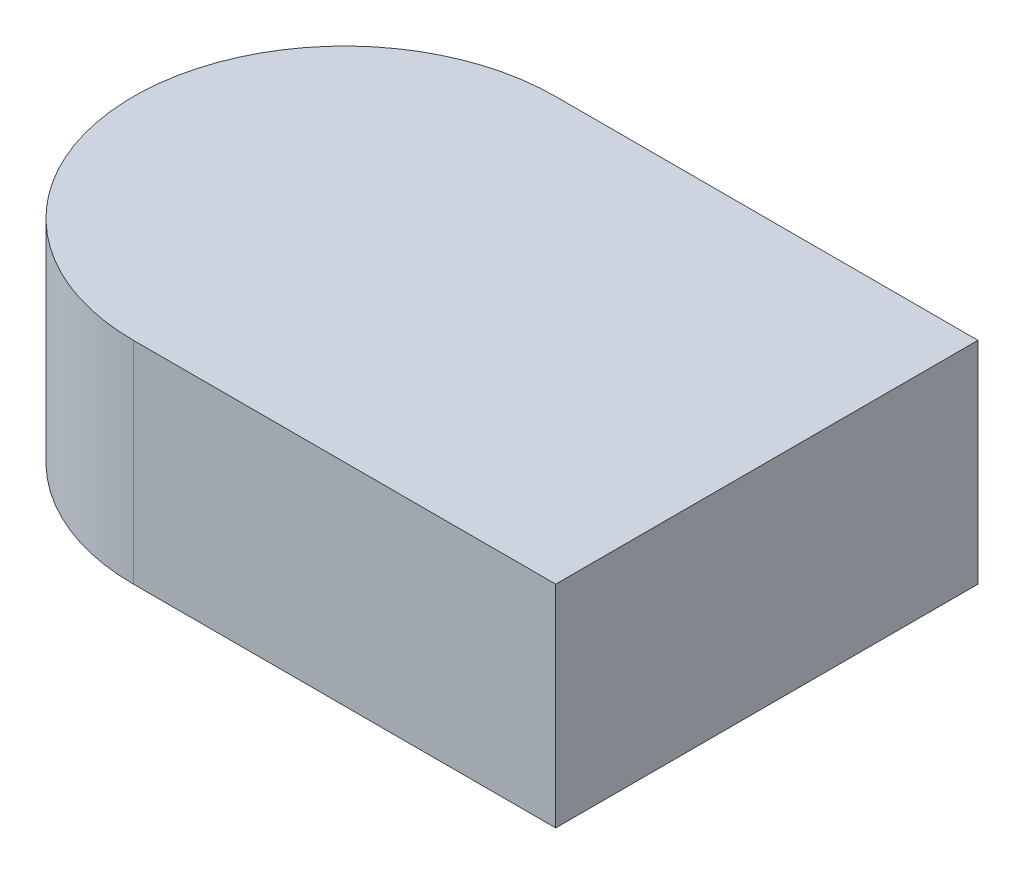
ISO-10303-21;
HEADER;
FILE_DESCRIPTION(('STEP AP214'),'2;1');
FILE_NAME('part.step','',(''),(''),'','','');
FILE_SCHEMA(('AUTOMOTIVE_DESIGN { 1 0 10303 214 1 1 1 1 }'));
ENDSEC;
DATA;
#1=APPLICATION_CONTEXT('core data for automotive mechanical design processes');
#2=APPLICATION_PROTOCOL_DEFINITION('international standard','automotive_design',2000,#1);
#3=PRODUCT_CONTEXT('',#1,'mechanical');
#4=PRODUCT('Part','Part','',(#3));
#5=PRODUCT_RELATED_PRODUCT_CATEGORY('part','',(#4));
#6=PRODUCT_DEFINITION_FORMATION('','',#4);
#7=PRODUCT_DEFINITION_CONTEXT('part definition',#1,'design');
#8=PRODUCT_DEFINITION('design','',#6,#7);
#9=PRODUCT_DEFINITION_SHAPE('','',#8);
#10=(LENGTH_UNIT() NAMED_UNIT(*) SI_UNIT(.MILLI.,.METRE.));
#11=(NAMED_UNIT(*) PLANE_ANGLE_UNIT() SI_UNIT($,.RADIAN.));
#12=(NAMED_UNIT(*) SI_UNIT($,.STERADIAN.) SOLID_ANGLE_UNIT());
#13=UNCERTAINTY_MEASURE_WITH_UNIT(LENGTH_MEASURE(1.E-05),#10,'distance_accuracy_value','');
#14=(GEOMETRIC_REPRESENTATION_CONTEXT(3) GLOBAL_UNCERTAINTY_ASSIGNED_CONTEXT((#13)) GLOBAL_UNIT_ASSIGNED_CONTEXT((#10,
#11,#12)) REPRESENTATION_CONTEXT('',''));
#15=CARTESIAN_POINT('',(0.,0.,0.));
#16=DIRECTION('',(0.,0.,1.));
#17=DIRECTION('',(1.,0.,0.));
#18=AXIS2_PLACEMENT_3D('',#15,#16,#17);
#19=CARTESIAN_POINT('',(0.,0.,0.));
#20=DIRECTION('',(0.,1.,0.));
#21=DIRECTION('',(1.,0.,0.));
#22=AXIS2_PLACEMENT_3D('',#19,#20,#21);
#23=PLANE('',#22);
#24=DIRECTION('',(0.,0.,-1.));
#25=VECTOR('',#24,1.);
#26=CARTESIAN_POINT('',(1.25,0.,1.1));
#27=LINE('',#26,#25);
#28=CARTESIAN_POINT('',(1.25,0.,1.1));
#29=VERTEX_POINT('',#28);
#30=CARTESIAN_POINT('',(1.25,0.,0.9));
#31=VERTEX_POINT('',#30);
#32=EDGE_CURVE('E11',#29,#31,#27,.T.);
#33=ORIENTED_EDGE('',*,*,#32,.F.);
#34=DIRECTION('',(1.,0.,0.));
#35=VECTOR('',#34,1.);
#36=CARTESIAN_POINT('',(1.05,0.,1.1));
#37=LINE('',#36,#35);
#38=CARTESIAN_POINT('',(1.05,0.,1.1));
#39=VERTEX_POINT('',#38);
#40=EDGE_CURVE('E25',#39,#29,#37,.T.);
#41=ORIENTED_EDGE('',*,*,#40,.F.);
#42=CARTESIAN_POINT('',(1.05,0.,1.));
#43=DIRECTION('',(0.,1.,0.));
#44=DIRECTION('',(0.,0.,-1.));
#45=AXIS2_PLACEMENT_3D('',#42,#43,#44);
#46=CIRCLE('',#45,0.1);
#47=CARTESIAN_POINT('',(1.05,0.,0.9));
#48=VERTEX_POINT('',#47);
#49=EDGE_CURVE('E73',#48,#39,#46,.T.);
#50=ORIENTED_EDGE('',*,*,#49,.F.);
#51=DIRECTION('',(-1.,0.,0.));
#52=VECTOR('',#51,1.);
#53=CARTESIAN_POINT('',(1.25,0.,0.9));
#54=LINE('',#53,#52);
#55=EDGE_CURVE('E99',#31,#48,#54,.T.);
#56=ORIENTED_EDGE('',*,*,#55,.F.);
#57=EDGE_LOOP('',(#33,#41,#50,#56));
#58=FACE_BOUND('',#57,.T.);
#59=ADVANCED_FACE('F17',(#58),#23,.F.);
#60=CARTESIAN_POINT('',(1.25,0.,0.9));
#61=DIRECTION('',(0.,0.,-1.));
#62=DIRECTION('',(-1.,0.,0.));
#63=AXIS2_PLACEMENT_3D('',#60,#61,#62);
#64=PLANE('',#63);
#65=DIRECTION('',(0.,1.,0.));
#66=VECTOR('',#65,1.);
#67=CARTESIAN_POINT('',(1.05,0.,0.9));
#68=LINE('',#67,#66);
#69=CARTESIAN_POINT('',(1.05,0.1,0.9));
#70=VERTEX_POINT('',#69);
#71=EDGE_CURVE('E95',#48,#70,#68,.T.);
#72=ORIENTED_EDGE('',*,*,#71,.T.);
#73=DIRECTION('',(-1.,0.,0.));
#74=VECTOR('',#73,1.);
#75=CARTESIAN_POINT('',(1.25,0.1,0.9));
#76=LINE('',#75,#74);
#77=CARTESIAN_POINT('',(1.25,0.1,0.9));
#78=VERTEX_POINT('',#77);
#79=EDGE_CURVE('E68',#78,#70,#76,.T.);
#80=ORIENTED_EDGE('',*,*,#79,.F.);
#81=DIRECTION('',(0.,1.,0.));
#82=VECTOR('',#81,1.);
#83=CARTESIAN_POINT('',(1.25,0.,0.9));
#84=LINE('',#83,#82);
#85=EDGE_CURVE('E87',#31,#78,#84,.T.);
#86=ORIENTED_EDGE('',*,*,#85,.F.);
#87=ORIENTED_EDGE('',*,*,#55,.T.);
#88=EDGE_LOOP('',(#72,#80,#86,#87));
#89=FACE_BOUND('',#88,.T.);
#90=ADVANCED_FACE('F113',(#89),#64,.T.);
#91=CARTESIAN_POINT('',(1.25,0.,1.1));
#92=DIRECTION('',(1.,0.,0.));
#93=DIRECTION('',(0.,0.,-1.));
#94=AXIS2_PLACEMENT_3D('',#91,#92,#93);
#95=PLANE('',#94);
#96=ORIENTED_EDGE('',*,*,#85,.T.);
#97=DIRECTION('',(0.,0.,-1.));
#98=VECTOR('',#97,1.);
#99=CARTESIAN_POINT('',(1.25,0.1,1.1));
#100=LINE('',#99,#98);
#101=CARTESIAN_POINT('',(1.25,0.1,1.1));
#102=VERTEX_POINT('',#101);
#103=EDGE_CURVE('E83',#102,#78,#100,.T.);
#104=ORIENTED_EDGE('',*,*,#103,.F.);
#105=DIRECTION('',(0.,1.,0.));
#106=VECTOR('',#105,1.);
#107=CARTESIAN_POINT('',(1.25,0.,1.1));
#108=LINE('',#107,#106);
#109=EDGE_CURVE('E60',#29,#102,#108,.T.);
#110=ORIENTED_EDGE('',*,*,#109,.F.);
#111=ORIENTED_EDGE('',*,*,#32,.T.);
#112=EDGE_LOOP('',(#96,#104,#110,#111));
#113=FACE_BOUND('',#112,.T.);
#114=ADVANCED_FACE('F119',(#113),#95,.T.);
#115=CARTESIAN_POINT('',(1.05,0.,1.1));
#116=DIRECTION('',(0.,0.,1.));
#117=DIRECTION('',(1.,0.,0.));
#118=AXIS2_PLACEMENT_3D('',#115,#116,#117);
#119=PLANE('',#118);
#120=ORIENTED_EDGE('',*,*,#109,.T.);
#121=DIRECTION('',(1.,0.,0.));
#122=VECTOR('',#121,1.);
#123=CARTESIAN_POINT('',(1.05,0.1,1.1));
#124=LINE('',#123,#122);
#125=CARTESIAN_POINT('',(1.05,0.1,1.1));
#126=VERTEX_POINT('',#125);
#127=EDGE_CURVE('E54',#126,#102,#124,.T.);
#128=ORIENTED_EDGE('',*,*,#127,.F.);
#129=DIRECTION('',(0.,1.,0.));
#130=VECTOR('',#129,1.);
#131=CARTESIAN_POINT('',(1.05,0.,1.1));
#132=LINE('',#131,#130);
#133=EDGE_CURVE('E58',#39,#126,#132,.T.);
#134=ORIENTED_EDGE('',*,*,#133,.F.);
#135=ORIENTED_EDGE('',*,*,#40,.T.);
#136=EDGE_LOOP('',(#120,#128,#134,#135));
#137=FACE_BOUND('',#136,.T.);
#138=ADVANCED_FACE('F56',(#137),#119,.T.);
#139=CARTESIAN_POINT('',(1.05,0.,1.));
#140=DIRECTION('',(0.,1.,0.));
#141=DIRECTION('',(1.,0.,0.));
#142=AXIS2_PLACEMENT_3D('',#139,#140,#141);
#143=CYLINDRICAL_SURFACE('',#142,0.1);
#144=ORIENTED_EDGE('',*,*,#133,.T.);
#145=CARTESIAN_POINT('',(1.05,0.1,1.));
#146=DIRECTION('',(0.,1.,0.));
#147=DIRECTION('',(0.,0.,-1.));
#148=AXIS2_PLACEMENT_3D('',#145,#146,#147);
#149=CIRCLE('',#148,0.1);
#150=EDGE_CURVE('E66',#70,#126,#149,.T.);
#151=ORIENTED_EDGE('',*,*,#150,.F.);
#152=ORIENTED_EDGE('',*,*,#71,.F.);
#153=ORIENTED_EDGE('',*,*,#49,.T.);
#154=EDGE_LOOP('',(#144,#151,#152,#153));
#155=FACE_BOUND('',#154,.T.);
#156=ADVANCED_FACE('F72',(#155),#143,.T.);
#157=CARTESIAN_POINT('',(0.,0.1,0.));
#158=DIRECTION('',(0.,1.,0.));
#159=DIRECTION('',(1.,0.,0.));
#160=AXIS2_PLACEMENT_3D('',#157,#158,#159);
#161=PLANE('',#160);
#162=ORIENTED_EDGE('',*,*,#150,.T.);
#163=ORIENTED_EDGE('',*,*,#127,.T.);
#164=ORIENTED_EDGE('',*,*,#103,.T.);
#165=ORIENTED_EDGE('',*,*,#79,.T.);
#166=EDGE_LOOP('',(#162,#163,#164,#165));
#167=FACE_BOUND('',#166,.T.);
#168=ADVANCED_FACE('F67',(#167),#161,.T.);
#169=CLOSED_SHELL('',(#59,#90,#114,#138,#156,#168));
#170=MANIFOLD_SOLID_BREP('B1',#169);
#171=ADVANCED_BREP_SHAPE_REPRESENTATION('',(#18,#170),#14);
#172=SHAPE_DEFINITION_REPRESENTATION(#9,#171);
ENDSEC;
END-ISO-10303-21;
